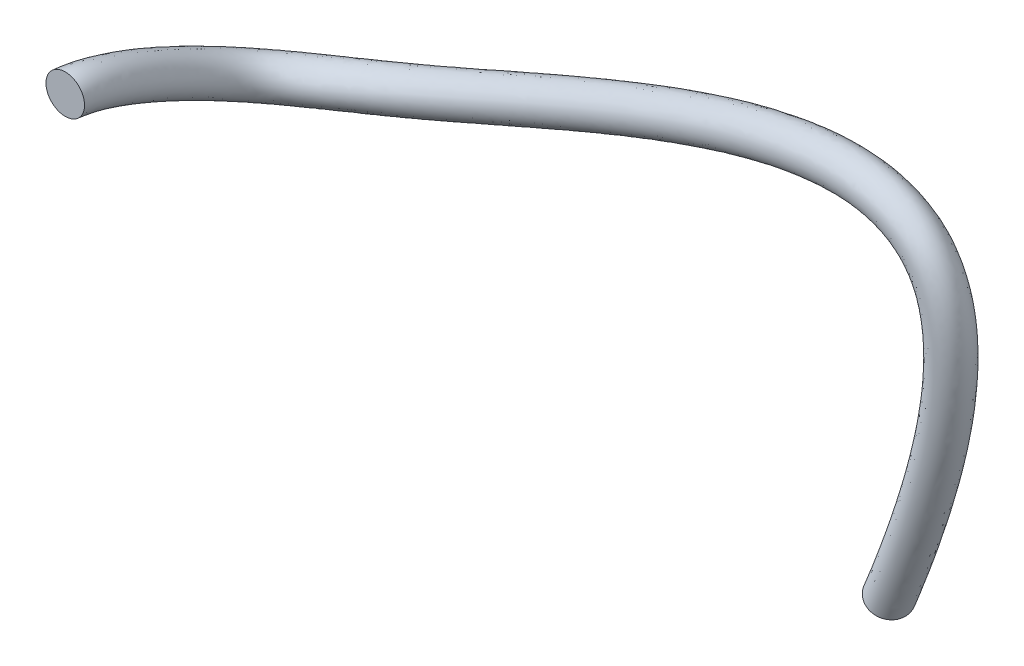
ISO-10303-21;
HEADER;
FILE_DESCRIPTION(('STEP AP214'),'2;1');
FILE_NAME('part.step','',(''),(''),'','','');
FILE_SCHEMA(('AUTOMOTIVE_DESIGN { 1 0 10303 214 1 1 1 1 }'));
ENDSEC;
DATA;
#1=APPLICATION_CONTEXT('core data for automotive mechanical design processes');
#2=APPLICATION_PROTOCOL_DEFINITION('international standard','automotive_design',2000,#1);
#3=PRODUCT_CONTEXT('',#1,'mechanical');
#4=PRODUCT('Part','Part','',(#3));
#5=PRODUCT_RELATED_PRODUCT_CATEGORY('part','',(#4));
#6=PRODUCT_DEFINITION_FORMATION('','',#4);
#7=PRODUCT_DEFINITION_CONTEXT('part definition',#1,'design');
#8=PRODUCT_DEFINITION('design','',#6,#7);
#9=PRODUCT_DEFINITION_SHAPE('','',#8);
#10=(LENGTH_UNIT() NAMED_UNIT(*) SI_UNIT(.MILLI.,.METRE.));
#11=(NAMED_UNIT(*) PLANE_ANGLE_UNIT() SI_UNIT($,.RADIAN.));
#12=(NAMED_UNIT(*) SI_UNIT($,.STERADIAN.) SOLID_ANGLE_UNIT());
#13=UNCERTAINTY_MEASURE_WITH_UNIT(LENGTH_MEASURE(1.E-05),#10,'distance_accuracy_value','');
#14=(GEOMETRIC_REPRESENTATION_CONTEXT(3) GLOBAL_UNCERTAINTY_ASSIGNED_CONTEXT((#13)) GLOBAL_UNIT_ASSIGNED_CONTEXT((#10,
#11,#12)) REPRESENTATION_CONTEXT('',''));
#15=CARTESIAN_POINT('',(0.,0.,0.));
#16=DIRECTION('',(0.,0.,1.));
#17=DIRECTION('',(1.,0.,0.));
#18=AXIS2_PLACEMENT_3D('',#15,#16,#17);
#19=CARTESIAN_POINT('',(0.,0.,0.));
#20=DIRECTION('',(0.,0.,1.));
#21=DIRECTION('',(1.,0.,0.));
#22=AXIS2_PLACEMENT_3D('',#19,#20,#21);
#23=PLANE('',#22);
#24=CARTESIAN_POINT('',(0.,0.,0.));
#25=DIRECTION('',(0.,0.,1.));
#26=DIRECTION('',(1.,0.,0.));
#27=AXIS2_PLACEMENT_3D('',#24,#25,#26);
#28=CIRCLE('',#27,2.5);
#29=CARTESIAN_POINT('',(2.5,0.,0.));
#30=VERTEX_POINT('',#29);
#31=EDGE_CURVE('E39',#30,#30,#28,.T.);
#32=ORIENTED_EDGE('',*,*,#31,.T.);
#33=EDGE_LOOP('',(#32));
#34=FACE_BOUND('',#33,.T.);
#35=ADVANCED_FACE('F32',(#34),#23,.T.);
#36=CARTESIAN_POINT('',(76.4199226864458,-33.2355451318995,-30.3155674539662));
#37=DIRECTION('',(0.419186755400574,0.887426692987594,0.191719400869713));
#38=DIRECTION('',(-0.00950954325004083,-0.206864736725287,0.978323335757026));
#39=AXIS2_PLACEMENT_3D('',#36,#37,#38);
#40=PLANE('',#39);
#41=CARTESIAN_POINT('',(76.4199226864458,-33.2355451318995,-30.3155674539662));
#42=DIRECTION('',(0.419186755400574,0.887426692987594,0.191719400869713));
#43=DIRECTION('',(-0.00950954325004083,-0.206864736725287,0.978323335757026));
#44=AXIS2_PLACEMENT_3D('',#41,#42,#43);
#45=CIRCLE('',#44,2.5);
#46=CARTESIAN_POINT('',(76.3961488283207,-33.7527069737127,-27.8697591145736));
#47=VERTEX_POINT('',#46);
#48=EDGE_CURVE('E11',#47,#47,#45,.T.);
#49=ORIENTED_EDGE('',*,*,#48,.F.);
#50=EDGE_LOOP('',(#49));
#51=FACE_BOUND('',#50,.T.);
#52=ADVANCED_FACE('F48',(#51),#40,.F.);
#53=CARTESIAN_POINT('',(2.5,0.,0.));
#54=CARTESIAN_POINT('',(2.58208481073779,-0.0158467400356572,-0.692665419918579));
#55=CARTESIAN_POINT('',(2.6364261639187,-0.102986828236506,-1.4122603807019));
#56=CARTESIAN_POINT('',(2.71640827223664,-0.379137054984448,-2.90756661317227));
#57=CARTESIAN_POINT('',(2.74167587507875,-0.568913873417586,-3.68319797993879));
#58=CARTESIAN_POINT('',(2.80148102459219,-1.25223046621308,-6.07520591340747));
#59=CARTESIAN_POINT('',(2.81993782992154,-1.86064475019609,-7.75829472747955));
#60=CARTESIAN_POINT('',(2.94828484431583,-3.17202843624497,-11.1101707033121));
#61=CARTESIAN_POINT('',(3.05888049490955,-3.8753579467365,-12.7784950721265));
#62=CARTESIAN_POINT('',(3.38445935970513,-4.83093477074236,-15.0814379697928));
#63=CARTESIAN_POINT('',(3.51951860986408,-5.13273490238899,-15.8153923469751));
#64=CARTESIAN_POINT('',(3.85155672838981,-5.67286038255171,-17.177172793132));
#65=CARTESIAN_POINT('',(4.04892969043007,-5.91541778072999,-17.8034401299664));
#66=CARTESIAN_POINT('',(4.77916473836143,-6.50095871221136,-19.5955223268075));
#67=CARTESIAN_POINT('',(5.42874285865337,-6.71589621847063,-20.5347456909981));
#68=CARTESIAN_POINT('',(6.99331578216039,-6.88860621195737,-22.1079637355269));
#69=CARTESIAN_POINT('',(7.92346344616779,-6.84844151869227,-22.7550326262948));
#70=CARTESIAN_POINT('',(10.1977863592561,-6.50084750656006,-23.9073714954043));
#71=CARTESIAN_POINT('',(11.5418211020271,-6.18925571136051,-24.4019590702484));
#72=CARTESIAN_POINT('',(13.8311608869212,-5.48493441772306,-25.0505516790809));
#73=CARTESIAN_POINT('',(14.638815544851,-5.2108789859827,-25.2514441005071));
#74=CARTESIAN_POINT('',(15.9062185464853,-4.73554866821554,-25.5402193434049));
#75=CARTESIAN_POINT('',(16.3379763167308,-4.56636637206378,-25.6344488221459));
#76=CARTESIAN_POINT('',(17.2178010237565,-4.20502324648035,-25.8218467971284));
#77=CARTESIAN_POINT('',(17.6697043089589,-4.02314083141192,-25.911252526077));
#78=CARTESIAN_POINT('',(21.8363697656222,-2.62641248455723,-26.5616774209841));
#79=CARTESIAN_POINT('',(26.070121786296,-0.96685290045689,-26.9634632628478));
#80=CARTESIAN_POINT('',(35.0495251761919,2.6555116492035,-27.4769062483474));
#81=CARTESIAN_POINT('',(39.7977555261467,4.61753884926037,-27.5904575968916));
#82=CARTESIAN_POINT('',(46.9279911084647,7.37679094752115,-27.61421849671));
#83=CARTESIAN_POINT('',(49.306306078725,8.26591913571226,-27.5977969046942));
#84=CARTESIAN_POINT('',(52.8306034797904,9.50229799822187,-27.5456047514017));
#85=CARTESIAN_POINT('',(53.9981857821626,9.89820305460167,-27.5236152341668));
#86=CARTESIAN_POINT('',(56.3115608436016,10.6489496421476,-27.4719509477851));
#87=CARTESIAN_POINT('',(57.4544371997199,11.0146927366287,-27.4465097944666));
#88=CARTESIAN_POINT('',(59.7308277672536,11.6244304819108,-27.3611700897686));
#89=CARTESIAN_POINT('',(60.8604154917907,11.8783074271902,-27.3065081212386));
#90=CARTESIAN_POINT('',(63.0705291220436,12.3614339800285,-27.2076539189019));
#91=CARTESIAN_POINT('',(64.1546754477788,12.578239134118,-27.1583943781069));
#92=CARTESIAN_POINT('',(67.3349796393727,13.1372381724667,-27.0104351252021));
#93=CARTESIAN_POINT('',(69.3591183721519,13.3879801820663,-26.9113840609644));
#94=CARTESIAN_POINT('',(73.1618001807214,13.5590284675592,-26.7176534335691));
#95=CARTESIAN_POINT('',(74.9406618453903,13.479561023908,-26.6231109769532));
#96=CARTESIAN_POINT('',(78.1924287679811,12.9022370647212,-26.4487090329119));
#97=CARTESIAN_POINT('',(79.6660159506688,12.4031359848805,-26.3688661381997));
#98=CARTESIAN_POINT('',(82.2224223810822,10.9045273998419,-26.2369816260357));
#99=CARTESIAN_POINT('',(83.3020348384362,9.90443435065615,-26.1851865804254));
#100=CARTESIAN_POINT('',(84.982503775816,7.37976843777567,-26.1224769132298));
#101=CARTESIAN_POINT('',(85.5852092379562,5.85914616571673,-26.1113866460858));
#102=CARTESIAN_POINT('',(86.2868214888031,2.25490248680488,-26.1391586315809));
#103=CARTESIAN_POINT('',(86.3867984608197,0.169184198125067,-26.1779720109517));
#104=CARTESIAN_POINT('',(86.0384450607148,-4.65184565959911,-26.3168417876368));
#105=CARTESIAN_POINT('',(85.5894818058363,-7.38757319094795,-26.4169527636139));
#106=CARTESIAN_POINT('',(83.3272466528658,-16.6883831018542,-26.8280395179672));
#107=CARTESIAN_POINT('',(80.597787660608,-24.3480903045905,-27.2498474442359));
#108=CARTESIAN_POINT('',(76.3961488283207,-33.7527069737127,-27.8697591145736));
#109=CARTESIAN_POINT('',(2.5,5.,0.));
#110=CARTESIAN_POINT('',(2.63080863037241,4.98415324597494,-1.07096726648057));
#111=CARTESIAN_POINT('',(2.70406782597138,4.858315395637,-2.06850365281876));
#112=CARTESIAN_POINT('',(2.80851739869851,4.50377835612424,-4.00228274683111));
#113=CARTESIAN_POINT('',(2.83814469494752,4.27168386337647,-4.93915594388565));
#114=CARTESIAN_POINT('',(2.90748007622516,3.47630221601347,-7.71905361330517));
#115=CARTESIAN_POINT('',(2.92750914178582,2.81157890801614,-9.53802357133016));
#116=CARTESIAN_POINT('',(3.06409129222381,1.43053304761868,-13.0625274620124));
#117=CARTESIAN_POINT('',(3.18109939027474,0.712189279495572,-14.7633852177691));
#118=CARTESIAN_POINT('',(3.50831753157738,-0.232944803913745,-17.0418528221737));
#119=CARTESIAN_POINT('',(3.64253241649559,-0.525624363443037,-17.7547480296582));
#120=CARTESIAN_POINT('',(3.96254323327937,-1.03444969958771,-19.0411815670084));
#121=CARTESIAN_POINT('',(4.15770704909023,-1.2534237031947,-19.6094512979982));
#122=CARTESIAN_POINT('',(4.73908217431288,-1.75371506319996,-21.1766996846248));
#123=CARTESIAN_POINT('',(5.23808267166659,-1.91596248824091,-21.9404597470133));
#124=CARTESIAN_POINT('',(6.43217195632109,-2.04851526443995,-23.2526839442448));
#125=CARTESIAN_POINT('',(7.15249488910716,-2.0211752573065,-23.8212466666769));
#126=CARTESIAN_POINT('',(9.06635254296623,-1.74218933494471,-24.9603360635077));
#127=CARTESIAN_POINT('',(10.2584182656306,-1.48203705014631,-25.5119614454042));
#128=CARTESIAN_POINT('',(12.3690377109707,-0.88544367415328,-26.3605763453549));
#129=CARTESIAN_POINT('',(13.1247754272902,-0.652812259984324,-26.6478195423014));
#130=CARTESIAN_POINT('',(14.326454979167,-0.258339703637611,-27.1097687977228));
#131=CARTESIAN_POINT('',(14.7383503044129,-0.119324017128235,-27.2691134059266));
#132=CARTESIAN_POINT('',(15.5832770553364,0.171414172215507,-27.6057314065597));
#133=CARTESIAN_POINT('',(16.0218027803885,0.321491950300309,-27.7575322941045));
#134=CARTESIAN_POINT('',(20.0828674580801,1.68645911789013,-28.3876687885168));
#135=CARTESIAN_POINT('',(24.2929295361174,3.33572291758869,-28.7881665903372));
#136=CARTESIAN_POINT('',(33.2916453697532,6.96681741449764,-29.299710237194));
#137=CARTESIAN_POINT('',(38.0851883143658,8.94755723614409,-29.4143412664545));
#138=CARTESIAN_POINT('',(45.3448769828483,11.7553920555283,-29.4373274713815));
#139=CARTESIAN_POINT('',(47.7770074961639,12.6642070180651,-29.4203047068748));
#140=CARTESIAN_POINT('',(51.403998476066,13.9353240532453,-29.3661498466009));
#141=CARTESIAN_POINT('',(52.6095148985773,14.3436750013964,-29.3433274207775));
#142=CARTESIAN_POINT('',(55.0078159444716,15.120941670897,-29.2895088223408));
#143=CARTESIAN_POINT('',(56.2006434957018,15.4926737627188,-29.2854860644132));
#144=CARTESIAN_POINT('',(58.5683462862354,16.1696935465474,-29.0918829252405));
#145=CARTESIAN_POINT('',(59.743219089622,16.4750350931096,-28.928867230193));
#146=CARTESIAN_POINT('',(62.0701085362819,17.0333490657011,-28.6849657337376));
#147=CARTESIAN_POINT('',(63.2221170854842,17.2835387104806,-28.5728855606097));
#148=CARTESIAN_POINT('',(66.6392937425208,17.9334686260999,-28.2567788170801));
#149=CARTESIAN_POINT('',(68.8647309840488,18.2343504234159,-28.0722690039488));
#150=CARTESIAN_POINT('',(73.2080829544999,18.4631989156615,-27.7307414706286));
#151=CARTESIAN_POINT('',(75.3287439955872,18.3936807340914,-27.5740169354053));
#152=CARTESIAN_POINT('',(79.4652510806301,17.6866070105868,-27.2812533139703));
#153=CARTESIAN_POINT('',(81.4938161264995,17.0420950966747,-27.1446220860941));
#154=CARTESIAN_POINT('',(85.2401448577472,14.893012167115,-26.9062593586124));
#155=CARTESIAN_POINT('',(86.9350954318292,13.3664358402176,-26.8063406117071));
#156=CARTESIAN_POINT('',(89.4870600785375,9.60988857902538,-26.675606745468));
#157=CARTESIAN_POINT('',(90.3383877521784,7.42192023507343,-26.6447098619572));
#158=CARTESIAN_POINT('',(91.2721180400438,2.71175539522762,-26.6466092960417));
#159=CARTESIAN_POINT('',(91.3744075691086,0.178081559486795,-26.6782207836419));
#160=CARTESIAN_POINT('',(90.9781186591848,-5.35270378674137,-26.8016048720866));
#161=CARTESIAN_POINT('',(90.4766130977296,-8.35659918523673,-26.8937055040371));
#162=CARTESIAN_POINT('',(88.0566602768627,-18.3112373099933,-27.2757205050687));
#163=CARTESIAN_POINT('',(85.2208060167636,-26.2172980347114,-27.6717067677991));
#164=CARTESIAN_POINT('',(80.9353999578682,-35.8123237176282,-28.2611387909559));
#165=CARTESIAN_POINT('',(-2.5,5.,0.));
#166=CARTESIAN_POINT('',(-2.36919136592495,5.03287707955317,-0.900807763147922));
#167=CARTESIAN_POINT('',(-2.28791673594034,4.95952422477903,-1.79057122164739));
#168=CARTESIAN_POINT('',(-2.17048050419977,4.68977323965694,-3.57521679936796));
#169=CARTESIAN_POINT('',(-2.13513568120681,4.49151316165381,-4.47088922167349));
#170=CARTESIAN_POINT('',(-2.05557413410493,3.77031157379845,-7.18415476277547));
#171=CARTESIAN_POINT('',(-2.03779669716157,3.12038744213291,-9.03146676277136));
#172=CARTESIAN_POINT('',(-1.91639530490942,1.70707866644975,-12.7096813766802));
#173=CARTESIAN_POINT('',(-1.81372722904105,0.942393008684328,-14.5368334144934));
#174=CARTESIAN_POINT('',(-1.49126246305325,-0.13695511207035,-17.1320690131907));
#175=CARTESIAN_POINT('',(-1.35567672474559,-0.48546802905495,-17.9726466119412));
#176=CARTESIAN_POINT('',(-1.01022338008836,-1.13447136347712,-19.5822682568652));
#177=CARTESIAN_POINT('',(-0.791776081981234,-1.42932591623489,-20.3491611759417));
#178=CARTESIAN_POINT('',(-0.0316549773749849,-2.3215664582636,-22.6902383602235));
#179=CARTESIAN_POINT('',(0.746307287549725,-2.75596747441092,-24.0914615349562));
#180=CARTESIAN_POINT('',(2.76471336638022,-3.27355463213807,-26.5019129636969));
#181=CARTESIAN_POINT('',(4.00008560742664,-3.35496977472078,-27.5050913775234));
#182=CARTESIAN_POINT('',(6.81553964356318,-3.23299725948393,-29.2028279028435));
#183=CARTESIAN_POINT('',(8.39443345731936,-3.02942818119016,-29.8998495200445));
#184=CARTESIAN_POINT('',(10.9901291361055,-2.60423972655168,-30.8522304263603));
#185=CARTESIAN_POINT('',(11.8937110453055,-2.44275043785727,-31.1545215437236));
#186=CARTESIAN_POINT('',(13.3090103081037,-2.19401770263772,-31.6070343341546));
#187=CARTESIAN_POINT('',(13.790814573317,-2.11014838529479,-31.7577688034017));
#188=CARTESIAN_POINT('',(14.7759798698174,-1.94706519274573,-32.0632586734205));
#189=CARTESIAN_POINT('',(15.2771625043295,-1.84893921299379,-32.2000671026701));
#190=CARTESIAN_POINT('',(19.6459396721536,-0.413884788546858,-32.9132977087865));
#191=CARTESIAN_POINT('',(24.0053185918674,1.28627140024853,-33.3412094987434));
#192=CARTESIAN_POINT('',(33.2164094649003,4.99365803030731,-33.8947241551845));
#193=CARTESIAN_POINT('',(38.0678526503741,7.00135313207774,-34.0201237943573));
#194=CARTESIAN_POINT('',(45.3679255784519,9.84074921726605,-34.0561934006731));
#195=CARTESIAN_POINT('',(47.8052636297921,10.7585881162951,-34.0428485936784));
#196=CARTESIAN_POINT('',(51.427014399454,12.0422309244898,-33.9938590122084));
#197=CARTESIAN_POINT('',(52.6285841443552,12.4545934316016,-33.9726974134621));
#198=CARTESIAN_POINT('',(55.0141486909866,13.2398771607402,-33.9221771190724));
#199=CARTESIAN_POINT('',(56.204019227641,13.5938116278773,-33.9113246062484));
#200=CARTESIAN_POINT('',(58.5208216929619,14.3796791565963,-33.7606794414845));
#201=CARTESIAN_POINT('',(59.6556041607377,14.7919014851425,-33.6369783097859));
#202=CARTESIAN_POINT('',(61.9214376334879,15.4972570196199,-33.4415657006619));
#203=CARTESIAN_POINT('',(63.045239705749,15.8124963527223,-33.3487944652049));
#204=CARTESIAN_POINT('',(66.3806355604676,16.6410649882182,-33.0818194538085));
#205=CARTESIAN_POINT('',(68.5551058045526,17.0390963783783,-32.9186787965621));
#206=CARTESIAN_POINT('',(72.7882590779327,17.4561674038209,-32.6115019962822));
#207=CARTESIAN_POINT('',(74.849051245491,17.4772696059971,-32.4674848243508));
#208=CARTESIAN_POINT('',(78.8559705418107,16.9859003980105,-32.1958977504847));
#209=CARTESIAN_POINT('',(80.8134528280508,16.4689617502702,-32.0677025204067));
#210=CARTESIAN_POINT('',(84.4550822155226,14.6381575319223,-31.8405093293706));
#211=CARTESIAN_POINT('',(86.1228297925256,13.3034577451555,-31.7428309761214));
#212=CARTESIAN_POINT('',(88.7115238668623,9.90657624657356,-31.6094894802712));
#213=CARTESIAN_POINT('',(89.6230860072363,7.87849594862521,-31.5740958633677));
#214=CARTESIAN_POINT('',(90.6961992062235,3.40569225092386,-31.5665415575864));
#215=CARTESIAN_POINT('',(90.8754968174733,0.953685279777206,-31.5932937843762));
#216=CARTESIAN_POINT('',(90.61884855511,-4.45835926821392,-31.7086904171385));
#217=CARTESIAN_POINT('',(90.1812413271327,-7.42434880566341,-31.7975536963386));
#218=CARTESIAN_POINT('',(87.9337287212381,-17.2967333607148,-32.171833142112));
#219=CARTESIAN_POINT('',(85.1888449719634,-25.1879153729512,-32.5651410615871));
#220=CARTESIAN_POINT('',(80.9829476741184,-34.7780000340017,-33.152755469741));
#221=CARTESIAN_POINT('',(-2.5,0.,0.));
#222=CARTESIAN_POINT('',(-2.41791518555957,0.0328770935425746,-0.522505916585932));
#223=CARTESIAN_POINT('',(-2.35555839799303,-0.00177799909447895,-1.13432794953045));
#224=CARTESIAN_POINT('',(-2.26258963066164,-0.19314217145175,-2.4805006657092));
#225=CARTESIAN_POINT('',(-2.23160450107558,-0.349084575140246,-3.2149312577268));
#226=CARTESIAN_POINT('',(-2.1615731857379,-0.9582211084281,-5.54030706287742));
#227=CARTESIAN_POINT('',(-2.14536800902586,-1.55183621607933,-7.25173791892034));
#228=CARTESIAN_POINT('',(-2.0322017528174,-2.8954828174139,-10.7573246179803));
#229=CARTESIAN_POINT('',(-1.93594612440584,-3.64515421754813,-12.5519432688509));
#230=CARTESIAN_POINT('',(-1.61512063492569,-4.73494507889877,-15.1716541608099));
#231=CARTESIAN_POINT('',(-1.4786905313771,-5.0925785680009,-16.0332909292584));
#232=CARTESIAN_POINT('',(-1.12120988497792,-5.77288204644112,-17.7182594829884));
#233=CARTESIAN_POINT('',(-0.90055344064139,-6.09131999376986,-18.5431500079098));
#234=CARTESIAN_POINT('',(0.00842758667356984,-7.06881010727573,-21.1090610024061));
#235=CARTESIAN_POINT('',(0.936967474536985,-7.55590120464065,-22.685747478941));
#236=CARTESIAN_POINT('',(3.32585719221904,-8.11364557965549,-25.3571927549791));
#237=CARTESIAN_POINT('',(4.77105416448694,-8.18223603610654,-26.4388773371414));
#238=CARTESIAN_POINT('',(7.94697345985341,-7.99165543109928,-28.1498633347401));
#239=CARTESIAN_POINT('',(9.67783629371589,-7.73664684240437,-28.7898471448902));
#240=CARTESIAN_POINT('',(12.452252312056,-7.20373047012146,-29.5422057600855));
#241=CARTESIAN_POINT('',(13.4077511628662,-7.0008171638548,-29.7581461019302));
#242=CARTESIAN_POINT('',(14.888773875422,-6.67122666721607,-30.0374848798362));
#243=CARTESIAN_POINT('',(15.3904405856348,-6.55719074023028,-30.1231042196211));
#244=CARTESIAN_POINT('',(16.4105038382375,-6.32350261144164,-30.2793740639893));
#245=CARTESIAN_POINT('',(16.9250640328998,-6.19357199470579,-30.3537873346431));
#246=CARTESIAN_POINT('',(21.3994419796957,-4.72675639099599,-31.0873063412503));
#247=CARTESIAN_POINT('',(25.7825108420417,-3.01630441779811,-31.516506171254));
#248=CARTESIAN_POINT('',(34.9742892713432,0.682352265014245,-32.0719201663379));
#249=CARTESIAN_POINT('',(39.780419862155,2.67133474519457,-32.1962401247943));
#250=CARTESIAN_POINT('',(46.9510397040684,5.46214810925863,-32.2330844260016));
#251=CARTESIAN_POINT('',(49.3345622123532,6.36030023394229,-32.2203407914977));
#252=CARTESIAN_POINT('',(52.8536194031784,7.60920486946633,-32.1733139170092));
#253=CARTESIAN_POINT('',(54.0172550279406,8.0091214848068,-32.1529852268514));
#254=CARTESIAN_POINT('',(56.3178935901166,8.76788513199077,-32.1046192445167));
#255=CARTESIAN_POINT('',(57.4578129316591,9.11583060178714,-32.0723483363018));
#256=CARTESIAN_POINT('',(59.6833031739801,9.8344160919597,-32.0299666060126));
#257=CARTESIAN_POINT('',(60.7728005629064,10.1951738192221,-32.0146192008306));
#258=CARTESIAN_POINT('',(62.9218582192497,10.8253419339484,-31.9642538858272));
#259=CARTESIAN_POINT('',(63.9777980680436,11.1071967763592,-31.934303282703));
#260=CARTESIAN_POINT('',(67.0763214573195,11.844834534586,-31.8354757619286));
#261=CARTESIAN_POINT('',(69.0494931926558,12.192726137029,-31.7577938535794));
#262=CARTESIAN_POINT('',(72.7419763041542,12.5519969557182,-31.5984139592211));
#263=CARTESIAN_POINT('',(74.4609690952942,12.5631498958148,-31.5165788658987));
#264=CARTESIAN_POINT('',(77.5831482291617,12.2015304521438,-31.3633534694263));
#265=CARTESIAN_POINT('',(78.98565265222,11.8300026384749,-31.2919465725123));
#266=CARTESIAN_POINT('',(81.4373597388576,10.6496727646505,-31.1712315967939));
#267=CARTESIAN_POINT('',(82.4897691991326,9.84145625559401,-31.1216769448397));
#268=CARTESIAN_POINT('',(84.2069675641408,7.67645610532385,-31.0563596480331));
#269=CARTESIAN_POINT('',(84.8699074930141,6.31572187926851,-31.0407726474948));
#270=CARTESIAN_POINT('',(85.7109026549828,2.94883934250112,-31.0590908931272));
#271=CARTESIAN_POINT('',(85.8878877091844,0.944787918415477,-31.0930450116881));
#272=CARTESIAN_POINT('',(85.6791749566401,-3.75750114107166,-31.2239273326867));
#273=CARTESIAN_POINT('',(85.2941100352394,-6.45532281137463,-31.3208009559209));
#274=CARTESIAN_POINT('',(83.2043150972412,-15.6738791525757,-31.7241521549995));
#275=CARTESIAN_POINT('',(80.5658266158077,-23.318707642866,-32.1432817380329));
#276=CARTESIAN_POINT('',(76.4436965445709,-32.7183832900862,-32.7613757933587));
#277=CARTESIAN_POINT('',(-2.5,-5.,0.));
#278=CARTESIAN_POINT('',(-2.46663900519419,-4.96712289246802,-0.144204070023942));
#279=CARTESIAN_POINT('',(-2.42320006004571,-4.96308022296799,-0.478084677413508));
#280=CARTESIAN_POINT('',(-2.35469875712351,-5.07605758256044,-1.38578453205044));
#281=CARTESIAN_POINT('',(-2.32807332094436,-5.18968231193431,-1.95897329378011));
#282=CARTESIAN_POINT('',(-2.26757223737086,-5.68675379065465,-3.89645936297937));
#283=CARTESIAN_POINT('',(-2.25293932089014,-6.22405987429157,-5.47200907506933));
#284=CARTESIAN_POINT('',(-2.14800820072538,-7.49804430127754,-8.8049678592804));
#285=CARTESIAN_POINT('',(-2.05816501977064,-8.23270144378059,-10.5670531232083));
#286=CARTESIAN_POINT('',(-1.73897880679814,-9.33293504572719,-13.211239308429));
#287=CARTESIAN_POINT('',(-1.6017043380086,-9.69968910694685,-14.0939352465756));
#288=CARTESIAN_POINT('',(-1.23219638986749,-10.4112927294051,-15.8542507091117));
#289=CARTESIAN_POINT('',(-1.00933079930155,-10.7533140713048,-16.737138839878));
#290=CARTESIAN_POINT('',(0.0485101507221245,-11.8160537562879,-19.5278836445888));
#291=CARTESIAN_POINT('',(1.12762766152425,-12.3558349348704,-21.2800334229257));
#292=CARTESIAN_POINT('',(3.88700101805787,-12.9537365271729,-24.2124725462613));
#293=CARTESIAN_POINT('',(5.54202272154723,-13.0095022974923,-25.3726632967593));
#294=CARTESIAN_POINT('',(9.07840727614363,-12.7503136027146,-27.0968987666367));
#295=CARTESIAN_POINT('',(10.9612391301124,-12.4438655036186,-27.679844769736));
#296=CARTESIAN_POINT('',(13.9143754880066,-11.8032212136912,-28.2321810938108));
#297=CARTESIAN_POINT('',(14.921791280427,-11.5588838898523,-28.3617706601368));
#298=CARTESIAN_POINT('',(16.4685374427403,-11.1484356317944,-28.4679354255178));
#299=CARTESIAN_POINT('',(16.9900665979527,-11.0042330951658,-28.4884396358404));
#300=CARTESIAN_POINT('',(18.0450278066577,-10.6999400301375,-28.495489454558));
#301=CARTESIAN_POINT('',(18.5729655614702,-10.5382047764178,-28.507507566616));
#302=CARTESIAN_POINT('',(23.1529442872379,-9.03962799344512,-29.261314973714));
#303=CARTESIAN_POINT('',(27.5597030922161,-7.31888023584476,-29.6918028437645));
#304=CARTESIAN_POINT('',(36.7321690777861,-3.62895350027883,-30.2491161774914));
#305=CARTESIAN_POINT('',(41.4929870739359,-1.65868364168859,-30.3723564552313));
#306=CARTESIAN_POINT('',(48.5341538296848,1.08354700125121,-30.4099754513301));
#307=CARTESIAN_POINT('',(50.8638607949143,1.96201235158947,-30.3978329893171));
#308=CARTESIAN_POINT('',(54.2802244069029,3.17617881444289,-30.35276882181));
#309=CARTESIAN_POINT('',(55.4059259115259,3.56364953801203,-30.3332730402408));
#310=CARTESIAN_POINT('',(57.6216384892466,4.29589310324137,-30.2870613699611));
#311=CARTESIAN_POINT('',(58.7116066356773,4.63784957569703,-30.2333720663552));
#312=CARTESIAN_POINT('',(60.8457846549984,5.28915302732313,-30.2992537705408));
#313=CARTESIAN_POINT('',(61.8899969650751,5.59844615330164,-30.3922600918752));
#314=CARTESIAN_POINT('',(63.9222788050114,6.15342684827681,-30.4869420709925));
#315=CARTESIAN_POINT('',(64.9103564303382,6.40189719999602,-30.5198121002011));
#316=CARTESIAN_POINT('',(67.7720073541713,7.04860408095375,-30.5891320700487));
#317=CARTESIAN_POINT('',(69.5438805807589,7.34635589567976,-30.5969089105966));
#318=CARTESIAN_POINT('',(72.6956935303756,7.64782650761537,-30.58532592216));
#319=CARTESIAN_POINT('',(74.0728869450974,7.64903018563247,-30.5656729074466));
#320=CARTESIAN_POINT('',(76.3103259165128,7.41716050627717,-30.530809188368));
#321=CARTESIAN_POINT('',(77.1578524763892,7.19104352667951,-30.5161906246179));
#322=CARTESIAN_POINT('',(78.4196372621926,6.66118799737865,-30.5019538642172));
#323=CARTESIAN_POINT('',(78.8567086057396,6.37945476603253,-30.500522913558));
#324=CARTESIAN_POINT('',(79.7024112614193,5.44633596407414,-30.5032298157949));
#325=CARTESIAN_POINT('',(80.1167289787919,4.75294780991182,-30.5074494316219));
#326=CARTESIAN_POINT('',(80.7256061037421,2.49198643407839,-30.5516402286679));
#327=CARTESIAN_POINT('',(80.9002786008955,0.935890557053747,-30.5927962389999));
#328=CARTESIAN_POINT('',(80.7395013581701,-3.0566430139294,-30.7391642482348));
#329=CARTESIAN_POINT('',(80.4069787433461,-5.48629681708585,-30.8440482155033));
#330=CARTESIAN_POINT('',(78.4749014732443,-14.0510249444366,-31.276471167887));
#331=CARTESIAN_POINT('',(75.9428082596521,-21.4494999127808,-31.7214224144786));
#332=CARTESIAN_POINT('',(71.9044454150235,-30.6587665461708,-32.3699961169764));
#333=CARTESIAN_POINT('',(2.5,-5.,0.));
#334=CARTESIAN_POINT('',(2.53336099110317,-5.01584672604626,-0.314363573356589));
#335=CARTESIAN_POINT('',(2.56878450186602,-5.06428905211002,-0.756017108585037));
#336=CARTESIAN_POINT('',(2.62429914577477,-5.26205246609314,-1.81285047951344));
#337=CARTESIAN_POINT('',(2.64520705520997,-5.40951161021165,-2.42724001599192));
#338=CARTESIAN_POINT('',(2.69548197295923,-5.98076314843963,-4.43135821350978));
#339=CARTESIAN_POINT('',(2.71236651805726,-6.53286840840833,-5.97856588362894));
#340=CARTESIAN_POINT('',(2.83247839640785,-7.77458992010861,-9.15781394461184));
#341=CARTESIAN_POINT('',(2.93666159954437,-8.46290517296857,-10.793604926484));
#342=CARTESIAN_POINT('',(3.26060118783287,-9.42892473757097,-13.121023117412));
#343=CARTESIAN_POINT('',(3.39650480323258,-9.73984544133494,-13.8760366642919));
#344=CARTESIAN_POINT('',(3.74057022350024,-10.3112710655157,-15.3131640192555));
#345=CARTESIAN_POINT('',(3.94015233176991,-10.5774118582653,-15.9974289619345));
#346=CARTESIAN_POINT('',(4.81924730240999,-11.2482023612227,-18.0143449689901));
#347=CARTESIAN_POINT('',(5.61940304564016,-11.5158299487004,-19.1290316349828));
#348=CARTESIAN_POINT('',(7.5544596079997,-11.7286971594748,-20.9632435268091));
#349=CARTESIAN_POINT('',(8.69443200322842,-11.675707780078,-21.6888185859128));
#350=CARTESIAN_POINT('',(11.329220175546,-11.2595056781754,-22.8544069273009));
#351=CARTESIAN_POINT('',(12.8252239384236,-10.8964743725747,-23.2919566950926));
#352=CARTESIAN_POINT('',(15.2932840628718,-10.0844251612928,-23.7405270128069));
#353=CARTESIAN_POINT('',(16.1528556624117,-9.76894571198107,-23.8550686587129));
#354=CARTESIAN_POINT('',(17.4859821138036,-9.21275763279347,-23.9706698890869));
#355=CARTESIAN_POINT('',(17.9376023290487,-9.01340872699932,-23.9997842383653));
#356=CARTESIAN_POINT('',(18.8523249921767,-8.5814606651762,-24.0379621876972));
#357=CARTESIAN_POINT('',(19.3176058375292,-8.36777361312414,-24.0649727580495));
#358=CARTESIAN_POINT('',(23.5898720731643,-6.93928408700459,-24.7356860534514));
#359=CARTESIAN_POINT('',(27.8473140364747,-5.26942871850247,-25.1387599353583));
#360=CARTESIAN_POINT('',(36.8074049826305,-1.65579411609063,-25.6541022595008));
#361=CARTESIAN_POINT('',(41.5103227379276,0.287520462376657,-25.7665739273286));
#362=CARTESIAN_POINT('',(48.5111052340812,2.99818983951401,-25.7911095220385));
#363=CARTESIAN_POINT('',(50.8356046612861,3.86763125335944,-25.7752891025135));
#364=CARTESIAN_POINT('',(54.2572084835149,5.06927194319843,-25.7250596562025));
#365=CARTESIAN_POINT('',(55.386856665748,5.45273110780691,-25.7039030475561));
#366=CARTESIAN_POINT('',(57.6153057427316,6.17695761339818,-25.6543930732295));
#367=CARTESIAN_POINT('',(58.7082309037381,6.53671171053856,-25.60753352452));
#368=CARTESIAN_POINT('',(60.8933092482718,7.07916741727427,-25.6304572542967));
#369=CARTESIAN_POINT('',(61.9776118939594,7.28157976127071,-25.6841490122842));
#370=CARTESIAN_POINT('',(64.0709497078053,7.68951889435602,-25.7303421040662));
#371=CARTESIAN_POINT('',(65.0872338100734,7.87293955775531,-25.743903195604));
#372=CARTESIAN_POINT('',(68.0306655362246,8.34100771883353,-25.764091433324));
#373=CARTESIAN_POINT('',(69.853505760255,8.5416099407166,-25.75049911798));
#374=CARTESIAN_POINT('',(73.1155174069429,8.65485801945678,-25.7045653965096));
#375=CARTESIAN_POINT('',(74.5525796951935,8.56544131372467,-25.6722050185011));
#376=CARTESIAN_POINT('',(76.9196064553322,8.11786711885554,-25.6161647518536));
#377=CARTESIAN_POINT('',(77.838215774838,7.76417687308643,-25.5931101903053));
#378=CARTESIAN_POINT('',(79.2046999044171,6.91604263256886,-25.5677038934591));
#379=CARTESIAN_POINT('',(79.6689742450432,6.44243286109466,-25.5640325491438));
#380=CARTESIAN_POINT('',(80.4779474730945,5.14964829652595,-25.5693470809917));
#381=CARTESIAN_POINT('',(80.832030723734,4.29637209636004,-25.5780634302144));
#382=CARTESIAN_POINT('',(81.3015249375623,1.79804957838215,-25.6317079671201));
#383=CARTESIAN_POINT('',(81.3991893525308,0.160286836763337,-25.6777232382615));
#384=CARTESIAN_POINT('',(81.0987714622449,-3.95098753245685,-25.832078703187));
#385=CARTESIAN_POINT('',(80.702350513943,-6.41854719665918,-25.9402000231908));
#386=CARTESIAN_POINT('',(78.5978330288688,-15.0655288937151,-26.3803585308658));
#387=CARTESIAN_POINT('',(75.9747693044524,-22.4788825744696,-26.8279881206727));
#388=CARTESIAN_POINT('',(71.8568976987733,-31.6930902297972,-27.4783794381913));
#389=CARTESIAN_POINT('',(2.5,0.,0.));
#390=CARTESIAN_POINT('',(2.58208481073779,-0.0158467400356572,-0.692665419918579));
#391=CARTESIAN_POINT('',(2.6364261639187,-0.102986828236506,-1.4122603807019));
#392=CARTESIAN_POINT('',(2.71640827223664,-0.379137054984448,-2.90756661317227));
#393=CARTESIAN_POINT('',(2.74167587507875,-0.568913873417586,-3.68319797993879));
#394=CARTESIAN_POINT('',(2.80148102459219,-1.25223046621308,-6.07520591340747));
#395=CARTESIAN_POINT('',(2.81993782992154,-1.86064475019609,-7.75829472747955));
#396=CARTESIAN_POINT('',(2.94828484431583,-3.17202843624497,-11.1101707033121));
#397=CARTESIAN_POINT('',(3.05888049490955,-3.8753579467365,-12.7784950721265));
#398=CARTESIAN_POINT('',(3.38445935970513,-4.83093477074236,-15.0814379697928));
#399=CARTESIAN_POINT('',(3.51951860986408,-5.13273490238899,-15.8153923469751));
#400=CARTESIAN_POINT('',(3.85155672838981,-5.67286038255171,-17.177172793132));
#401=CARTESIAN_POINT('',(4.04892969043007,-5.91541778072999,-17.8034401299664));
#402=CARTESIAN_POINT('',(4.77916473836143,-6.50095871221136,-19.5955223268075));
#403=CARTESIAN_POINT('',(5.42874285865337,-6.71589621847063,-20.5347456909981));
#404=CARTESIAN_POINT('',(6.99331578216039,-6.88860621195737,-22.1079637355269));
#405=CARTESIAN_POINT('',(7.92346344616779,-6.84844151869227,-22.7550326262948));
#406=CARTESIAN_POINT('',(10.1977863592561,-6.50084750656006,-23.9073714954043));
#407=CARTESIAN_POINT('',(11.5418211020271,-6.18925571136051,-24.4019590702484));
#408=CARTESIAN_POINT('',(13.8311608869212,-5.48493441772306,-25.0505516790809));
#409=CARTESIAN_POINT('',(14.638815544851,-5.2108789859827,-25.2514441005071));
#410=CARTESIAN_POINT('',(15.9062185464853,-4.73554866821554,-25.5402193434049));
#411=CARTESIAN_POINT('',(16.3379763167308,-4.56636637206378,-25.6344488221459));
#412=CARTESIAN_POINT('',(17.2178010237565,-4.20502324648035,-25.8218467971284));
#413=CARTESIAN_POINT('',(17.6697043089589,-4.02314083141192,-25.911252526077));
#414=CARTESIAN_POINT('',(21.8363697656222,-2.62641248455723,-26.5616774209841));
#415=CARTESIAN_POINT('',(26.070121786296,-0.96685290045689,-26.9634632628478));
#416=CARTESIAN_POINT('',(35.0495251761919,2.6555116492035,-27.4769062483474));
#417=CARTESIAN_POINT('',(39.7977555261467,4.61753884926037,-27.5904575968916));
#418=CARTESIAN_POINT('',(46.9279911084647,7.37679094752115,-27.61421849671));
#419=CARTESIAN_POINT('',(49.306306078725,8.26591913571226,-27.5977969046942));
#420=CARTESIAN_POINT('',(52.8306034797904,9.50229799822187,-27.5456047514017));
#421=CARTESIAN_POINT('',(53.9981857821626,9.89820305460167,-27.5236152341668));
#422=CARTESIAN_POINT('',(56.3115608436016,10.6489496421476,-27.4719509477851));
#423=CARTESIAN_POINT('',(57.4544371997199,11.0146927366287,-27.4465097944666));
#424=CARTESIAN_POINT('',(59.7308277672536,11.6244304819108,-27.3611700897686));
#425=CARTESIAN_POINT('',(60.8604154917907,11.8783074271902,-27.3065081212386));
#426=CARTESIAN_POINT('',(63.0705291220436,12.3614339800285,-27.2076539189019));
#427=CARTESIAN_POINT('',(64.1546754477788,12.578239134118,-27.1583943781069));
#428=CARTESIAN_POINT('',(67.3349796393727,13.1372381724667,-27.0104351252021));
#429=CARTESIAN_POINT('',(69.3591183721519,13.3879801820663,-26.9113840609644));
#430=CARTESIAN_POINT('',(73.1618001807214,13.5590284675592,-26.7176534335691));
#431=CARTESIAN_POINT('',(74.9406618453903,13.479561023908,-26.6231109769532));
#432=CARTESIAN_POINT('',(78.1924287679811,12.9022370647212,-26.4487090329119));
#433=CARTESIAN_POINT('',(79.6660159506688,12.4031359848805,-26.3688661381997));
#434=CARTESIAN_POINT('',(82.2224223810822,10.9045273998419,-26.2369816260357));
#435=CARTESIAN_POINT('',(83.3020348384362,9.90443435065615,-26.1851865804254));
#436=CARTESIAN_POINT('',(84.982503775816,7.37976843777567,-26.1224769132298));
#437=CARTESIAN_POINT('',(85.5852092379562,5.85914616571673,-26.1113866460858));
#438=CARTESIAN_POINT('',(86.2868214888031,2.25490248680488,-26.1391586315809));
#439=CARTESIAN_POINT('',(86.3867984608197,0.169184198125067,-26.1779720109517));
#440=CARTESIAN_POINT('',(86.0384450607148,-4.65184565959911,-26.3168417876368));
#441=CARTESIAN_POINT('',(85.5894818058363,-7.38757319094795,-26.4169527636139));
#442=CARTESIAN_POINT('',(83.3272466528658,-16.6883831018542,-26.8280395179672));
#443=CARTESIAN_POINT('',(80.597787660608,-24.3480903045905,-27.2498474442359));
#444=CARTESIAN_POINT('',(76.3961488283207,-33.7527069737127,-27.8697591145736));
#445=(BOUNDED_SURFACE() B_SPLINE_SURFACE(3,3,((#53,#54,#55,#56,#57,#58,#59,#60,#61,#62,#63,#64,
#65,#66,#67,#68,#69,#70,#71,#72,#73,#74,#75,#76,#77,#78,#79,#80,#81,#82,#83,#84,#85,#86,#87,#88,
#89,#90,#91,#92,#93,#94,#95,#96,#97,#98,#99,#100,#101,#102,#103,#104,#105,#106,#107,#108),(#109,
#110,#111,#112,#113,#114,#115,#116,#117,#118,#119,#120,#121,#122,#123,#124,#125,#126,#127,#128,
#129,#130,#131,#132,#133,#134,#135,#136,#137,#138,#139,#140,#141,#142,#143,#144,#145,#146,#147,
#148,#149,#150,#151,#152,#153,#154,#155,#156,#157,#158,#159,#160,#161,#162,#163,#164),(#165,
#166,#167,#168,#169,#170,#171,#172,#173,#174,#175,#176,#177,#178,#179,#180,#181,#182,#183,#184,
#185,#186,#187,#188,#189,#190,#191,#192,#193,#194,#195,#196,#197,#198,#199,#200,#201,#202,#203,
#204,#205,#206,#207,#208,#209,#210,#211,#212,#213,#214,#215,#216,#217,#218,#219,#220),(#221,
#222,#223,#224,#225,#226,#227,#228,#229,#230,#231,#232,#233,#234,#235,#236,#237,#238,#239,#240,
#241,#242,#243,#244,#245,#246,#247,#248,#249,#250,#251,#252,#253,#254,#255,#256,#257,#258,#259,
#260,#261,#262,#263,#264,#265,#266,#267,#268,#269,#270,#271,#272,#273,#274,#275,#276),(#277,
#278,#279,#280,#281,#282,#283,#284,#285,#286,#287,#288,#289,#290,#291,#292,#293,#294,#295,#296,
#297,#298,#299,#300,#301,#302,#303,#304,#305,#306,#307,#308,#309,#310,#311,#312,#313,#314,#315,
#316,#317,#318,#319,#320,#321,#322,#323,#324,#325,#326,#327,#328,#329,#330,#331,#332),(#333,
#334,#335,#336,#337,#338,#339,#340,#341,#342,#343,#344,#345,#346,#347,#348,#349,#350,#351,#352,
#353,#354,#355,#356,#357,#358,#359,#360,#361,#362,#363,#364,#365,#366,#367,#368,#369,#370,#371,
#372,#373,#374,#375,#376,#377,#378,#379,#380,#381,#382,#383,#384,#385,#386,#387,#388),(#389,
#390,#391,#392,#393,#394,#395,#396,#397,#398,#399,#400,#401,#402,#403,#404,#405,#406,#407,#408,
#409,#410,#411,#412,#413,#414,#415,#416,#417,#418,#419,#420,#421,#422,#423,#424,#425,#426,#427,
#428,#429,#430,#431,#432,#433,#434,#435,#436,#437,#438,#439,#440,#441,#442,#443,#444)),
.UNSPECIFIED.,.T.,.F.,.F.) B_SPLINE_SURFACE_WITH_KNOTS((4,3,4),(4,2,2,2,2,2,2,2,2,2,2,2,2,2,2,2,
2,2,2,2,2,2,2,2,2,2,2,4),(0.,0.5,1.),(0.,0.0193926663879659,0.0387853327759318,
0.0775706655518636,0.116355998327795,0.135748664715761,0.155141331103727,0.198257526400062,
0.241373721696396,0.284489916992731,0.306048014640898,0.316827063464982,0.327606112289065,
0.411655348252932,0.495704584216799,0.537729202198733,0.558741511189699,0.579753820180666,
0.600766129171633,0.621778438162599,0.663803056144533,0.705827674126466,0.7478522921084,
0.789876910090333,0.831901528072266,0.8739261460542,0.915950764036133,1.),
.UNSPECIFIED.) GEOMETRIC_REPRESENTATION_ITEM() RATIONAL_B_SPLINE_SURFACE(((1.,1.,1.,1.,1.,1.,1.,
1.,1.,1.,1.,1.,1.,1.,1.,1.,1.,1.,1.,1.,1.,1.,1.,1.,1.,1.,1.,1.,1.,1.,1.,1.,1.,1.,1.,1.,1.,1.,1.,
1.,1.,1.,1.,1.,1.,1.,1.,1.,1.,1.,1.,1.,1.,1.,1.,1.),(0.333333333333333,0.333333333333333,
0.333333333333333,0.333333333333333,0.333333333333333,0.333333333333333,0.333333333333333,
0.333333333333333,0.333333333333333,0.333333333333333,0.333333333333333,0.333333333333333,
0.333333333333333,0.333333333333333,0.333333333333333,0.333333333333333,0.333333333333333,
0.333333333333333,0.333333333333333,0.333333333333333,0.333333333333333,0.333333333333333,
0.333333333333333,0.333333333333333,0.333333333333333,0.333333333333333,0.333333333333333,
0.333333333333333,0.333333333333333,0.333333333333333,0.333333333333333,0.333333333333333,
0.333333333333333,0.333333333333333,0.333333333333333,0.333333333333333,0.333333333333333,
0.333333333333333,0.333333333333333,0.333333333333333,0.333333333333333,0.333333333333333,
0.333333333333333,0.333333333333333,0.333333333333333,0.333333333333333,0.333333333333333,
0.333333333333333,0.333333333333333,0.333333333333333,0.333333333333333,0.333333333333333,
0.333333333333333,0.333333333333333,0.333333333333333,0.333333333333333),(0.333333333333333,
0.333333333333333,0.333333333333333,0.333333333333333,0.333333333333333,0.333333333333333,
0.333333333333333,0.333333333333333,0.333333333333333,0.333333333333333,0.333333333333333,
0.333333333333333,0.333333333333333,0.333333333333333,0.333333333333333,0.333333333333333,
0.333333333333333,0.333333333333333,0.333333333333333,0.333333333333333,0.333333333333333,
0.333333333333333,0.333333333333333,0.333333333333333,0.333333333333333,0.333333333333333,
0.333333333333333,0.333333333333333,0.333333333333333,0.333333333333333,0.333333333333333,
0.333333333333333,0.333333333333333,0.333333333333333,0.333333333333333,0.333333333333333,
0.333333333333333,0.333333333333333,0.333333333333333,0.333333333333333,0.333333333333333,
0.333333333333333,0.333333333333333,0.333333333333333,0.333333333333333,0.333333333333333,
0.333333333333333,0.333333333333333,0.333333333333333,0.333333333333333,0.333333333333333,
0.333333333333333,0.333333333333333,0.333333333333333,0.333333333333333,0.333333333333333),(1.,
1.,1.,1.,1.,1.,1.,1.,1.,1.,1.,1.,1.,1.,1.,1.,1.,1.,1.,1.,1.,1.,1.,1.,1.,1.,1.,1.,1.,1.,1.,1.,1.,
1.,1.,1.,1.,1.,1.,1.,1.,1.,1.,1.,1.,1.,1.,1.,1.,1.,1.,1.,1.,1.,1.,1.),(0.333333333333333,
0.333333333333333,0.333333333333333,0.333333333333333,0.333333333333333,0.333333333333333,
0.333333333333333,0.333333333333333,0.333333333333333,0.333333333333333,0.333333333333333,
0.333333333333333,0.333333333333333,0.333333333333333,0.333333333333333,0.333333333333333,
0.333333333333333,0.333333333333333,0.333333333333333,0.333333333333333,0.333333333333333,
0.333333333333333,0.333333333333333,0.333333333333333,0.333333333333333,0.333333333333333,
0.333333333333333,0.333333333333333,0.333333333333333,0.333333333333333,0.333333333333333,
0.333333333333333,0.333333333333333,0.333333333333333,0.333333333333333,0.333333333333333,
0.333333333333333,0.333333333333333,0.333333333333333,0.333333333333333,0.333333333333333,
0.333333333333333,0.333333333333333,0.333333333333333,0.333333333333333,0.333333333333333,
0.333333333333333,0.333333333333333,0.333333333333333,0.333333333333333,0.333333333333333,
0.333333333333333,0.333333333333333,0.333333333333333,0.333333333333333,0.333333333333333),
(0.333333333333333,0.333333333333333,0.333333333333333,0.333333333333333,0.333333333333333,
0.333333333333333,0.333333333333333,0.333333333333333,0.333333333333333,0.333333333333333,
0.333333333333333,0.333333333333333,0.333333333333333,0.333333333333333,0.333333333333333,
0.333333333333333,0.333333333333333,0.333333333333333,0.333333333333333,0.333333333333333,
0.333333333333333,0.333333333333333,0.333333333333333,0.333333333333333,0.333333333333333,
0.333333333333333,0.333333333333333,0.333333333333333,0.333333333333333,0.333333333333333,
0.333333333333333,0.333333333333333,0.333333333333333,0.333333333333333,0.333333333333333,
0.333333333333333,0.333333333333333,0.333333333333333,0.333333333333333,0.333333333333333,
0.333333333333333,0.333333333333333,0.333333333333333,0.333333333333333,0.333333333333333,
0.333333333333333,0.333333333333333,0.333333333333333,0.333333333333333,0.333333333333333,
0.333333333333333,0.333333333333333,0.333333333333333,0.333333333333333,0.333333333333333,
0.333333333333333),(1.,1.,1.,1.,1.,1.,1.,1.,1.,1.,1.,1.,1.,1.,1.,1.,1.,1.,1.,1.,1.,1.,1.,1.,1.,
1.,1.,1.,1.,1.,1.,1.,1.,1.,1.,1.,1.,1.,1.,1.,1.,1.,1.,1.,1.,1.,1.,1.,1.,1.,1.,1.,1.,1.,1.,1.))) REPRESENTATION_ITEM('') SURFACE());
#446=ORIENTED_EDGE('',*,*,#48,.T.);
#447=EDGE_LOOP('',(#446));
#448=FACE_BOUND('',#447,.T.);
#449=ORIENTED_EDGE('',*,*,#31,.F.);
#450=EDGE_LOOP('',(#449));
#451=FACE_BOUND('',#450,.T.);
#452=ADVANCED_FACE('F46',(#448,#451),#445,.F.);
#453=CLOSED_SHELL('',(#35,#52,#452));
#454=MANIFOLD_SOLID_BREP('B2',#453);
#455=ADVANCED_BREP_SHAPE_REPRESENTATION('',(#18,#454),#14);
#456=SHAPE_DEFINITION_REPRESENTATION(#9,#455);
ENDSEC;
END-ISO-10303-21;
